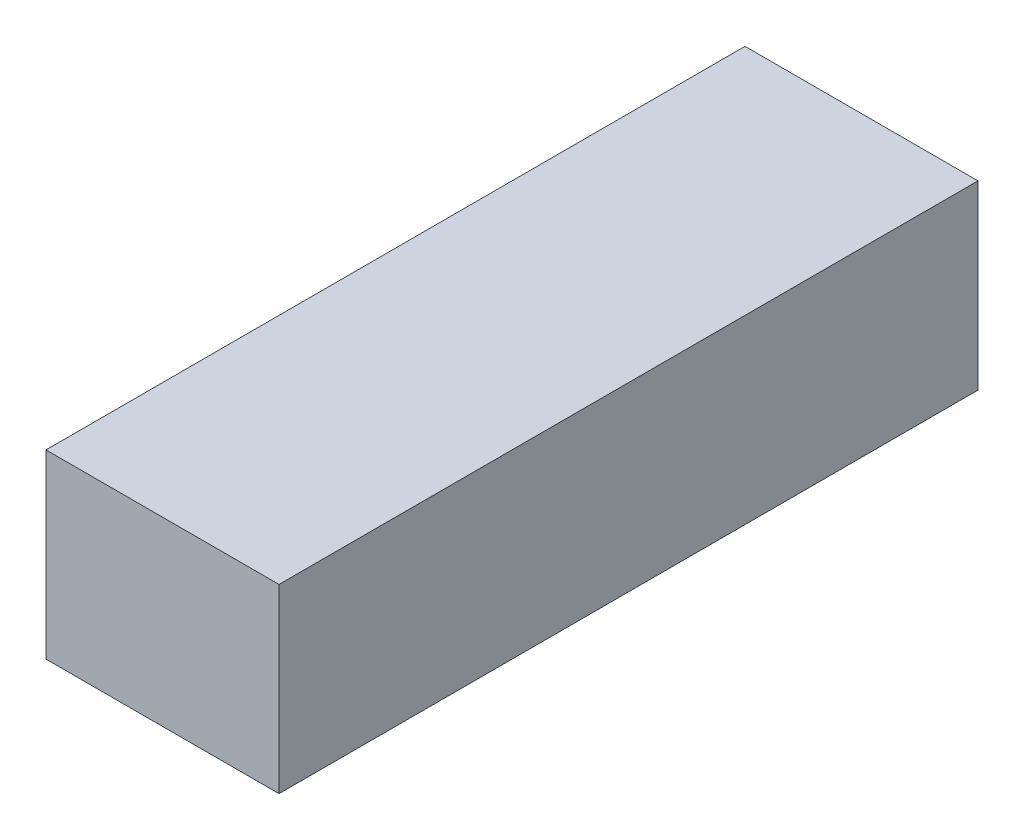
ISO-10303-21;
HEADER;
FILE_DESCRIPTION(('STEP AP214'),'2;1');
FILE_NAME('part.step','',(''),(''),'','','');
FILE_SCHEMA(('AUTOMOTIVE_DESIGN { 1 0 10303 214 1 1 1 1 }'));
ENDSEC;
DATA;
#1=APPLICATION_CONTEXT('core data for automotive mechanical design processes');
#2=APPLICATION_PROTOCOL_DEFINITION('international standard','automotive_design',2000,#1);
#3=PRODUCT_CONTEXT('',#1,'mechanical');
#4=PRODUCT('Part','Part','',(#3));
#5=PRODUCT_RELATED_PRODUCT_CATEGORY('part','',(#4));
#6=PRODUCT_DEFINITION_FORMATION('','',#4);
#7=PRODUCT_DEFINITION_CONTEXT('part definition',#1,'design');
#8=PRODUCT_DEFINITION('design','',#6,#7);
#9=PRODUCT_DEFINITION_SHAPE('','',#8);
#10=(LENGTH_UNIT() NAMED_UNIT(*) SI_UNIT(.MILLI.,.METRE.));
#11=(NAMED_UNIT(*) PLANE_ANGLE_UNIT() SI_UNIT($,.RADIAN.));
#12=(NAMED_UNIT(*) SI_UNIT($,.STERADIAN.) SOLID_ANGLE_UNIT());
#13=UNCERTAINTY_MEASURE_WITH_UNIT(LENGTH_MEASURE(1.E-05),#10,'distance_accuracy_value','');
#14=(GEOMETRIC_REPRESENTATION_CONTEXT(3) GLOBAL_UNCERTAINTY_ASSIGNED_CONTEXT((#13)) GLOBAL_UNIT_ASSIGNED_CONTEXT((#10,
#11,#12)) REPRESENTATION_CONTEXT('',''));
#15=CARTESIAN_POINT('',(0.,0.,0.));
#16=DIRECTION('',(0.,0.,1.));
#17=DIRECTION('',(1.,0.,0.));
#18=AXIS2_PLACEMENT_3D('',#15,#16,#17);
#19=CARTESIAN_POINT('',(22.5,35.,-67.5));
#20=DIRECTION('',(-1.,0.,0.));
#21=DIRECTION('',(0.,0.,1.));
#22=AXIS2_PLACEMENT_3D('',#19,#20,#21);
#23=PLANE('',#22);
#24=DIRECTION('',(0.,0.,-1.));
#25=VECTOR('',#24,1.);
#26=CARTESIAN_POINT('',(22.5,0.,-67.5));
#27=LINE('',#26,#25);
#28=CARTESIAN_POINT('',(22.5,0.,67.5));
#29=VERTEX_POINT('',#28);
#30=CARTESIAN_POINT('',(22.5,0.,-67.5));
#31=VERTEX_POINT('',#30);
#32=EDGE_CURVE('E100',#29,#31,#27,.T.);
#33=ORIENTED_EDGE('',*,*,#32,.T.);
#34=DIRECTION('',(0.,-1.,0.));
#35=VECTOR('',#34,1.);
#36=CARTESIAN_POINT('',(22.5,35.,-67.5));
#37=LINE('',#36,#35);
#38=CARTESIAN_POINT('',(22.5,35.,-67.5));
#39=VERTEX_POINT('',#38);
#40=EDGE_CURVE('E11',#39,#31,#37,.T.);
#41=ORIENTED_EDGE('',*,*,#40,.F.);
#42=DIRECTION('',(0.,0.,-1.));
#43=VECTOR('',#42,1.);
#44=CARTESIAN_POINT('',(22.5,35.,-67.5));
#45=LINE('',#44,#43);
#46=CARTESIAN_POINT('',(22.5,35.,67.5));
#47=VERTEX_POINT('',#46);
#48=EDGE_CURVE('E88',#47,#39,#45,.T.);
#49=ORIENTED_EDGE('',*,*,#48,.F.);
#50=DIRECTION('',(0.,-1.,0.));
#51=VECTOR('',#50,1.);
#52=CARTESIAN_POINT('',(22.5,35.,67.5));
#53=LINE('',#52,#51);
#54=EDGE_CURVE('E96',#47,#29,#53,.T.);
#55=ORIENTED_EDGE('',*,*,#54,.T.);
#56=EDGE_LOOP('',(#33,#41,#49,#55));
#57=FACE_BOUND('',#56,.T.);
#58=ADVANCED_FACE('F37',(#57),#23,.F.);
#59=CARTESIAN_POINT('',(-22.5,35.,-67.5));
#60=DIRECTION('',(0.,0.,1.));
#61=DIRECTION('',(1.,0.,0.));
#62=AXIS2_PLACEMENT_3D('',#59,#60,#61);
#63=PLANE('',#62);
#64=DIRECTION('',(-1.,0.,0.));
#65=VECTOR('',#64,1.);
#66=CARTESIAN_POINT('',(-22.5,0.,-67.5));
#67=LINE('',#66,#65);
#68=CARTESIAN_POINT('',(-22.5,0.,-67.5));
#69=VERTEX_POINT('',#68);
#70=EDGE_CURVE('E92',#31,#69,#67,.T.);
#71=ORIENTED_EDGE('',*,*,#70,.T.);
#72=DIRECTION('',(0.,-1.,0.));
#73=VECTOR('',#72,1.);
#74=CARTESIAN_POINT('',(-22.5,35.,-67.5));
#75=LINE('',#74,#73);
#76=CARTESIAN_POINT('',(-22.5,35.,-67.5));
#77=VERTEX_POINT('',#76);
#78=EDGE_CURVE('E45',#77,#69,#75,.T.);
#79=ORIENTED_EDGE('',*,*,#78,.F.);
#80=DIRECTION('',(-1.,0.,0.));
#81=VECTOR('',#80,1.);
#82=CARTESIAN_POINT('',(-22.5,35.,-67.5));
#83=LINE('',#82,#81);
#84=EDGE_CURVE('E83',#39,#77,#83,.T.);
#85=ORIENTED_EDGE('',*,*,#84,.F.);
#86=ORIENTED_EDGE('',*,*,#40,.T.);
#87=EDGE_LOOP('',(#71,#79,#85,#86));
#88=FACE_BOUND('',#87,.T.);
#89=ADVANCED_FACE('F91',(#88),#63,.F.);
#90=CARTESIAN_POINT('',(-22.5,35.,-67.5));
#91=DIRECTION('',(1.,0.,0.));
#92=DIRECTION('',(0.,0.,-1.));
#93=AXIS2_PLACEMENT_3D('',#90,#91,#92);
#94=PLANE('',#93);
#95=DIRECTION('',(0.,0.,1.));
#96=VECTOR('',#95,1.);
#97=CARTESIAN_POINT('',(-22.5,0.,-67.5));
#98=LINE('',#97,#96);
#99=CARTESIAN_POINT('',(-22.5,0.,67.5));
#100=VERTEX_POINT('',#99);
#101=EDGE_CURVE('E70',#69,#100,#98,.T.);
#102=ORIENTED_EDGE('',*,*,#101,.T.);
#103=DIRECTION('',(0.,-1.,0.));
#104=VECTOR('',#103,1.);
#105=CARTESIAN_POINT('',(-22.5,35.,67.5));
#106=LINE('',#105,#104);
#107=CARTESIAN_POINT('',(-22.5,35.,67.5));
#108=VERTEX_POINT('',#107);
#109=EDGE_CURVE('E93',#108,#100,#106,.T.);
#110=ORIENTED_EDGE('',*,*,#109,.F.);
#111=DIRECTION('',(0.,0.,1.));
#112=VECTOR('',#111,1.);
#113=CARTESIAN_POINT('',(-22.5,35.,-67.5));
#114=LINE('',#113,#112);
#115=EDGE_CURVE('E86',#77,#108,#114,.T.);
#116=ORIENTED_EDGE('',*,*,#115,.F.);
#117=ORIENTED_EDGE('',*,*,#78,.T.);
#118=EDGE_LOOP('',(#102,#110,#116,#117));
#119=FACE_BOUND('',#118,.T.);
#120=ADVANCED_FACE('F94',(#119),#94,.F.);
#121=CARTESIAN_POINT('',(-22.5,35.,67.5));
#122=DIRECTION('',(0.,0.,-1.));
#123=DIRECTION('',(-1.,0.,0.));
#124=AXIS2_PLACEMENT_3D('',#121,#122,#123);
#125=PLANE('',#124);
#126=DIRECTION('',(1.,0.,0.));
#127=VECTOR('',#126,1.);
#128=CARTESIAN_POINT('',(-22.5,0.,67.5));
#129=LINE('',#128,#127);
#130=EDGE_CURVE('E76',#100,#29,#129,.T.);
#131=ORIENTED_EDGE('',*,*,#130,.T.);
#132=ORIENTED_EDGE('',*,*,#54,.F.);
#133=DIRECTION('',(1.,0.,0.));
#134=VECTOR('',#133,1.);
#135=CARTESIAN_POINT('',(-22.5,35.,67.5));
#136=LINE('',#135,#134);
#137=EDGE_CURVE('E53',#108,#47,#136,.T.);
#138=ORIENTED_EDGE('',*,*,#137,.F.);
#139=ORIENTED_EDGE('',*,*,#109,.T.);
#140=EDGE_LOOP('',(#131,#132,#138,#139));
#141=FACE_BOUND('',#140,.T.);
#142=ADVANCED_FACE('F107',(#141),#125,.F.);
#143=CARTESIAN_POINT('',(0.,35.,0.));
#144=DIRECTION('',(0.,1.,0.));
#145=DIRECTION('',(0.,0.,1.));
#146=AXIS2_PLACEMENT_3D('',#143,#144,#145);
#147=PLANE('',#146);
#148=ORIENTED_EDGE('',*,*,#48,.T.);
#149=ORIENTED_EDGE('',*,*,#84,.T.);
#150=ORIENTED_EDGE('',*,*,#115,.T.);
#151=ORIENTED_EDGE('',*,*,#137,.T.);
#152=EDGE_LOOP('',(#148,#149,#150,#151));
#153=FACE_BOUND('',#152,.T.);
#154=ADVANCED_FACE('F84',(#153),#147,.T.);
#155=CARTESIAN_POINT('',(0.,0.,0.));
#156=DIRECTION('',(0.,1.,0.));
#157=DIRECTION('',(0.,0.,1.));
#158=AXIS2_PLACEMENT_3D('',#155,#156,#157);
#159=PLANE('',#158);
#160=ORIENTED_EDGE('',*,*,#32,.F.);
#161=ORIENTED_EDGE('',*,*,#130,.F.);
#162=ORIENTED_EDGE('',*,*,#101,.F.);
#163=ORIENTED_EDGE('',*,*,#70,.F.);
#164=EDGE_LOOP('',(#160,#161,#162,#163));
#165=FACE_BOUND('',#164,.T.);
#166=ADVANCED_FACE('F110',(#165),#159,.F.);
#167=CLOSED_SHELL('',(#58,#89,#120,#142,#154,#166));
#168=MANIFOLD_SOLID_BREP('B2',#167);
#169=ADVANCED_BREP_SHAPE_REPRESENTATION('',(#18,#168),#14);
#170=SHAPE_DEFINITION_REPRESENTATION(#9,#169);
ENDSEC;
END-ISO-10303-21;
